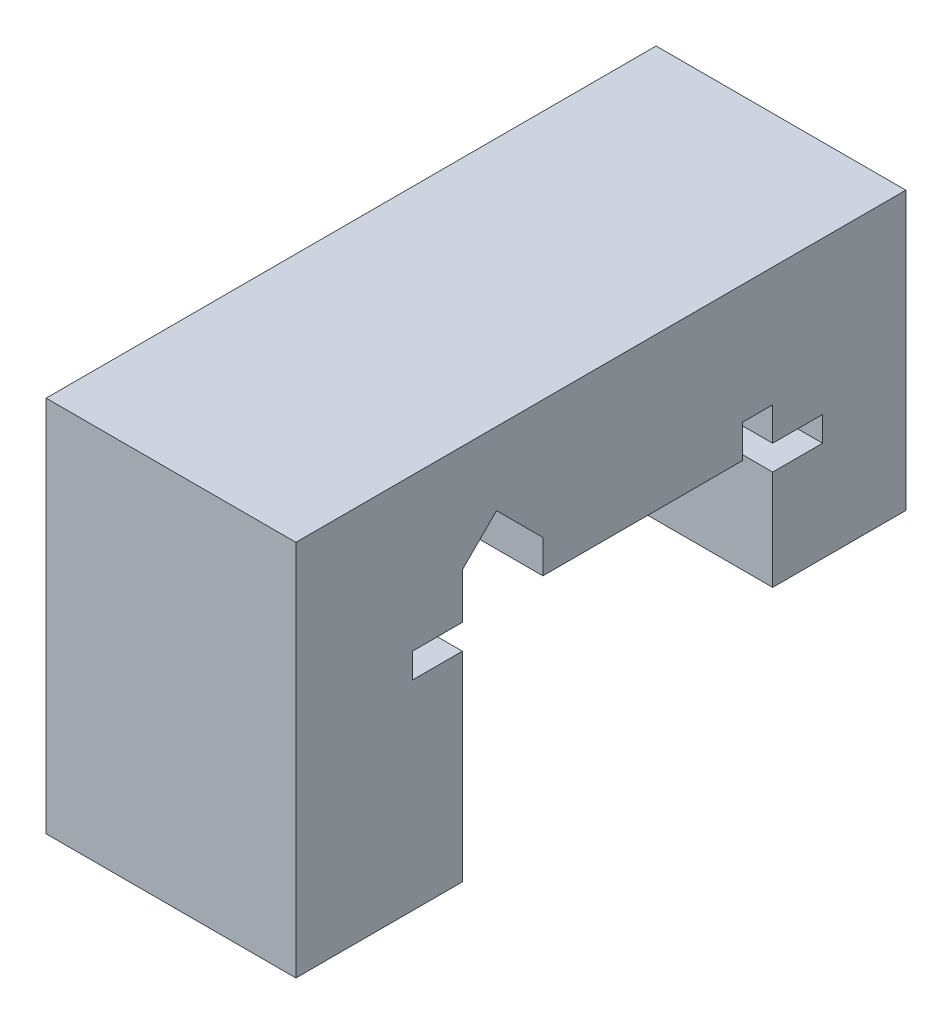
ISO-10303-21;
HEADER;
FILE_DESCRIPTION(('STEP AP214'),'2;1');
FILE_NAME('part.step','',(''),(''),'','','');
FILE_SCHEMA(('AUTOMOTIVE_DESIGN { 1 0 10303 214 1 1 1 1 }'));
ENDSEC;
DATA;
#1=APPLICATION_CONTEXT('core data for automotive mechanical design processes');
#2=APPLICATION_PROTOCOL_DEFINITION('international standard','automotive_design',2000,#1);
#3=PRODUCT_CONTEXT('',#1,'mechanical');
#4=PRODUCT('Part','Part','',(#3));
#5=PRODUCT_RELATED_PRODUCT_CATEGORY('part','',(#4));
#6=PRODUCT_DEFINITION_FORMATION('','',#4);
#7=PRODUCT_DEFINITION_CONTEXT('part definition',#1,'design');
#8=PRODUCT_DEFINITION('design','',#6,#7);
#9=PRODUCT_DEFINITION_SHAPE('','',#8);
#10=(LENGTH_UNIT() NAMED_UNIT(*) SI_UNIT(.MILLI.,.METRE.));
#11=(NAMED_UNIT(*) PLANE_ANGLE_UNIT() SI_UNIT($,.RADIAN.));
#12=(NAMED_UNIT(*) SI_UNIT($,.STERADIAN.) SOLID_ANGLE_UNIT());
#13=UNCERTAINTY_MEASURE_WITH_UNIT(LENGTH_MEASURE(1.E-05),#10,'distance_accuracy_value','');
#14=(GEOMETRIC_REPRESENTATION_CONTEXT(3) GLOBAL_UNCERTAINTY_ASSIGNED_CONTEXT((#13)) GLOBAL_UNIT_ASSIGNED_CONTEXT((#10,
#11,#12)) REPRESENTATION_CONTEXT('',''));
#15=CARTESIAN_POINT('',(0.,0.,0.));
#16=DIRECTION('',(0.,0.,1.));
#17=DIRECTION('',(1.,0.,0.));
#18=AXIS2_PLACEMENT_3D('',#15,#16,#17);
#19=CARTESIAN_POINT('',(150.,0.,0.));
#20=DIRECTION('',(0.,1.,0.));
#21=DIRECTION('',(0.,0.,1.));
#22=AXIS2_PLACEMENT_3D('',#19,#20,#21);
#23=PLANE('',#22);
#24=DIRECTION('',(0.,0.,-1.));
#25=VECTOR('',#24,1.);
#26=CARTESIAN_POINT('',(0.,0.,0.));
#27=LINE('',#26,#25);
#28=CARTESIAN_POINT('',(0.,0.,60.));
#29=VERTEX_POINT('',#28);
#30=CARTESIAN_POINT('',(0.,0.,-60.));
#31=VERTEX_POINT('',#30);
#32=EDGE_CURVE('E130',#29,#31,#27,.T.);
#33=ORIENTED_EDGE('',*,*,#32,.T.);
#34=DIRECTION('',(-1.,0.,0.));
#35=VECTOR('',#34,1.);
#36=CARTESIAN_POINT('',(150.,0.,-60.));
#37=LINE('',#36,#35);
#38=CARTESIAN_POINT('',(150.,0.,-60.));
#39=VERTEX_POINT('',#38);
#40=EDGE_CURVE('E11',#39,#31,#37,.T.);
#41=ORIENTED_EDGE('',*,*,#40,.F.);
#42=DIRECTION('',(0.,0.,-1.));
#43=VECTOR('',#42,1.);
#44=CARTESIAN_POINT('',(150.,0.,0.));
#45=LINE('',#44,#43);
#46=CARTESIAN_POINT('',(150.,0.,60.));
#47=VERTEX_POINT('',#46);
#48=EDGE_CURVE('E136',#47,#39,#45,.T.);
#49=ORIENTED_EDGE('',*,*,#48,.F.);
#50=DIRECTION('',(-1.,0.,0.));
#51=VECTOR('',#50,1.);
#52=CARTESIAN_POINT('',(150.,0.,60.));
#53=LINE('',#52,#51);
#54=EDGE_CURVE('E214',#47,#29,#53,.T.);
#55=ORIENTED_EDGE('',*,*,#54,.T.);
#56=EDGE_LOOP('',(#33,#41,#49,#55));
#57=FACE_BOUND('',#56,.T.);
#58=ADVANCED_FACE('F38',(#57),#23,.F.);
#59=CARTESIAN_POINT('',(150.,20.,-60.));
#60=DIRECTION('',(0.,0.,1.));
#61=DIRECTION('',(1.,0.,0.));
#62=AXIS2_PLACEMENT_3D('',#59,#60,#61);
#63=PLANE('',#62);
#64=DIRECTION('',(0.,1.,0.));
#65=VECTOR('',#64,1.);
#66=CARTESIAN_POINT('',(0.,20.,-60.));
#67=LINE('',#66,#65);
#68=CARTESIAN_POINT('',(0.,20.,-60.));
#69=VERTEX_POINT('',#68);
#70=EDGE_CURVE('E220',#31,#69,#67,.T.);
#71=ORIENTED_EDGE('',*,*,#70,.T.);
#72=DIRECTION('',(-1.,0.,0.));
#73=VECTOR('',#72,1.);
#74=CARTESIAN_POINT('',(150.,20.,-60.));
#75=LINE('',#74,#73);
#76=CARTESIAN_POINT('',(150.,20.,-60.));
#77=VERTEX_POINT('',#76);
#78=EDGE_CURVE('E47',#77,#69,#75,.T.);
#79=ORIENTED_EDGE('',*,*,#78,.F.);
#80=DIRECTION('',(0.,1.,0.));
#81=VECTOR('',#80,1.);
#82=CARTESIAN_POINT('',(150.,20.,-60.));
#83=LINE('',#82,#81);
#84=EDGE_CURVE('E442',#39,#77,#83,.T.);
#85=ORIENTED_EDGE('',*,*,#84,.F.);
#86=ORIENTED_EDGE('',*,*,#40,.T.);
#87=EDGE_LOOP('',(#71,#79,#85,#86));
#88=FACE_BOUND('',#87,.T.);
#89=ADVANCED_FACE('F449',(#88),#63,.F.);
#90=CARTESIAN_POINT('',(150.,20.,-78.0038961668402));
#91=DIRECTION('',(0.,1.,0.));
#92=DIRECTION('',(0.,0.,1.));
#93=AXIS2_PLACEMENT_3D('',#90,#91,#92);
#94=PLANE('',#93);
#95=DIRECTION('',(0.,0.,-1.));
#96=VECTOR('',#95,1.);
#97=CARTESIAN_POINT('',(0.,20.,-78.0038961668402));
#98=LINE('',#97,#96);
#99=CARTESIAN_POINT('',(0.,20.,-78.0038961668402));
#100=VERTEX_POINT('',#99);
#101=EDGE_CURVE('E223',#69,#100,#98,.T.);
#102=ORIENTED_EDGE('',*,*,#101,.T.);
#103=DIRECTION('',(-1.,0.,0.));
#104=VECTOR('',#103,1.);
#105=CARTESIAN_POINT('',(150.,20.,-78.0038961668402));
#106=LINE('',#105,#104);
#107=CARTESIAN_POINT('',(150.,20.,-78.0038961668402));
#108=VERTEX_POINT('',#107);
#109=EDGE_CURVE('E341',#108,#100,#106,.T.);
#110=ORIENTED_EDGE('',*,*,#109,.F.);
#111=DIRECTION('',(0.,0.,-1.));
#112=VECTOR('',#111,1.);
#113=CARTESIAN_POINT('',(150.,20.,-78.0038961668402));
#114=LINE('',#113,#112);
#115=EDGE_CURVE('E353',#77,#108,#114,.T.);
#116=ORIENTED_EDGE('',*,*,#115,.F.);
#117=ORIENTED_EDGE('',*,*,#78,.T.);
#118=EDGE_LOOP('',(#102,#110,#116,#117));
#119=FACE_BOUND('',#118,.T.);
#120=ADVANCED_FACE('F351',(#119),#94,.F.);
#121=CARTESIAN_POINT('',(150.,0.,-78.0038961668402));
#122=DIRECTION('',(0.,0.,-1.));
#123=DIRECTION('',(-1.,0.,0.));
#124=AXIS2_PLACEMENT_3D('',#121,#122,#123);
#125=PLANE('',#124);
#126=DIRECTION('',(0.,-1.,0.));
#127=VECTOR('',#126,1.);
#128=CARTESIAN_POINT('',(0.,0.,-78.0038961668402));
#129=LINE('',#128,#127);
#130=CARTESIAN_POINT('',(0.,0.,-78.0038961668402));
#131=VERTEX_POINT('',#130);
#132=EDGE_CURVE('E226',#100,#131,#129,.T.);
#133=ORIENTED_EDGE('',*,*,#132,.T.);
#134=DIRECTION('',(-1.,0.,0.));
#135=VECTOR('',#134,1.);
#136=CARTESIAN_POINT('',(150.,0.,-78.0038961668402));
#137=LINE('',#136,#135);
#138=CARTESIAN_POINT('',(150.,0.,-78.0038961668402));
#139=VERTEX_POINT('',#138);
#140=EDGE_CURVE('E337',#139,#131,#137,.T.);
#141=ORIENTED_EDGE('',*,*,#140,.F.);
#142=DIRECTION('',(0.,-1.,0.));
#143=VECTOR('',#142,1.);
#144=CARTESIAN_POINT('',(150.,0.,-78.0038961668402));
#145=LINE('',#144,#143);
#146=EDGE_CURVE('E372',#108,#139,#145,.T.);
#147=ORIENTED_EDGE('',*,*,#146,.F.);
#148=ORIENTED_EDGE('',*,*,#109,.T.);
#149=EDGE_LOOP('',(#133,#141,#147,#148));
#150=FACE_BOUND('',#149,.T.);
#151=ADVANCED_FACE('F362',(#150),#125,.F.);
#152=CARTESIAN_POINT('',(150.,0.,-78.0038961668402));
#153=DIRECTION('',(0.,1.,0.));
#154=DIRECTION('',(0.,0.,1.));
#155=AXIS2_PLACEMENT_3D('',#152,#153,#154);
#156=PLANE('',#155);
#157=DIRECTION('',(0.,0.,-1.));
#158=VECTOR('',#157,1.);
#159=CARTESIAN_POINT('',(0.,0.,-78.0038961668402));
#160=LINE('',#159,#158);
#161=CARTESIAN_POINT('',(0.,0.,-108.00389616684));
#162=VERTEX_POINT('',#161);
#163=EDGE_CURVE('E229',#131,#162,#160,.T.);
#164=ORIENTED_EDGE('',*,*,#163,.T.);
#165=DIRECTION('',(-1.,0.,0.));
#166=VECTOR('',#165,1.);
#167=CARTESIAN_POINT('',(150.,0.,-108.00389616684));
#168=LINE('',#167,#166);
#169=CARTESIAN_POINT('',(150.,0.,-108.00389616684));
#170=VERTEX_POINT('',#169);
#171=EDGE_CURVE('E333',#170,#162,#168,.T.);
#172=ORIENTED_EDGE('',*,*,#171,.F.);
#173=DIRECTION('',(0.,0.,-1.));
#174=VECTOR('',#173,1.);
#175=CARTESIAN_POINT('',(150.,0.,-78.0038961668402));
#176=LINE('',#175,#174);
#177=EDGE_CURVE('E368',#139,#170,#176,.T.);
#178=ORIENTED_EDGE('',*,*,#177,.F.);
#179=ORIENTED_EDGE('',*,*,#140,.T.);
#180=EDGE_LOOP('',(#164,#172,#178,#179));
#181=FACE_BOUND('',#180,.T.);
#182=ADVANCED_FACE('F366',(#181),#156,.F.);
#183=CARTESIAN_POINT('',(150.,0.,-108.00389616684));
#184=DIRECTION('',(0.,0.,-1.));
#185=DIRECTION('',(-1.,0.,0.));
#186=AXIS2_PLACEMENT_3D('',#183,#184,#185);
#187=PLANE('',#186);
#188=DIRECTION('',(0.,-1.,0.));
#189=VECTOR('',#188,1.);
#190=CARTESIAN_POINT('',(0.,0.,-108.00389616684));
#191=LINE('',#190,#189);
#192=CARTESIAN_POINT('',(0.,-15.,-108.00389616684));
#193=VERTEX_POINT('',#192);
#194=EDGE_CURVE('E232',#162,#193,#191,.T.);
#195=ORIENTED_EDGE('',*,*,#194,.T.);
#196=DIRECTION('',(-1.,0.,0.));
#197=VECTOR('',#196,1.);
#198=CARTESIAN_POINT('',(150.,-15.,-108.00389616684));
#199=LINE('',#198,#197);
#200=CARTESIAN_POINT('',(150.,-15.,-108.00389616684));
#201=VERTEX_POINT('',#200);
#202=EDGE_CURVE('E329',#201,#193,#199,.T.);
#203=ORIENTED_EDGE('',*,*,#202,.F.);
#204=DIRECTION('',(0.,-1.,0.));
#205=VECTOR('',#204,1.);
#206=CARTESIAN_POINT('',(150.,0.,-108.00389616684));
#207=LINE('',#206,#205);
#208=EDGE_CURVE('E371',#170,#201,#207,.T.);
#209=ORIENTED_EDGE('',*,*,#208,.F.);
#210=ORIENTED_EDGE('',*,*,#171,.T.);
#211=EDGE_LOOP('',(#195,#203,#209,#210));
#212=FACE_BOUND('',#211,.T.);
#213=ADVANCED_FACE('F461',(#212),#187,.F.);
#214=CARTESIAN_POINT('',(150.,-15.,-108.00389616684));
#215=DIRECTION('',(0.,-1.,0.));
#216=DIRECTION('',(0.,0.,-1.));
#217=AXIS2_PLACEMENT_3D('',#214,#215,#216);
#218=PLANE('',#217);
#219=DIRECTION('',(0.,0.,1.));
#220=VECTOR('',#219,1.);
#221=CARTESIAN_POINT('',(0.,-15.,-108.00389616684));
#222=LINE('',#221,#220);
#223=CARTESIAN_POINT('',(0.,-15.,-78.0038961668402));
#224=VERTEX_POINT('',#223);
#225=EDGE_CURVE('E235',#193,#224,#222,.T.);
#226=ORIENTED_EDGE('',*,*,#225,.T.);
#227=DIRECTION('',(-1.,0.,0.));
#228=VECTOR('',#227,1.);
#229=CARTESIAN_POINT('',(150.,-15.,-78.0038961668402));
#230=LINE('',#229,#228);
#231=CARTESIAN_POINT('',(150.,-15.,-78.0038961668402));
#232=VERTEX_POINT('',#231);
#233=EDGE_CURVE('E325',#232,#224,#230,.T.);
#234=ORIENTED_EDGE('',*,*,#233,.F.);
#235=DIRECTION('',(0.,0.,1.));
#236=VECTOR('',#235,1.);
#237=CARTESIAN_POINT('',(150.,-15.,-108.00389616684));
#238=LINE('',#237,#236);
#239=EDGE_CURVE('E377',#201,#232,#238,.T.);
#240=ORIENTED_EDGE('',*,*,#239,.F.);
#241=ORIENTED_EDGE('',*,*,#202,.T.);
#242=EDGE_LOOP('',(#226,#234,#240,#241));
#243=FACE_BOUND('',#242,.T.);
#244=ADVANCED_FACE('F464',(#243),#218,.F.);
#245=CARTESIAN_POINT('',(150.,-15.,-78.0038961668402));
#246=DIRECTION('',(0.,0.,-1.));
#247=DIRECTION('',(0.,1.,0.));
#248=AXIS2_PLACEMENT_3D('',#245,#246,#247);
#249=PLANE('',#248);
#250=DIRECTION('',(0.,-1.,0.));
#251=VECTOR('',#250,1.);
#252=CARTESIAN_POINT('',(0.,-15.,-78.0038961668402));
#253=LINE('',#252,#251);
#254=CARTESIAN_POINT('',(0.,-75.,-78.0038961668402));
#255=VERTEX_POINT('',#254);
#256=EDGE_CURVE('E238',#224,#255,#253,.T.);
#257=ORIENTED_EDGE('',*,*,#256,.T.);
#258=DIRECTION('',(-1.,0.,0.));
#259=VECTOR('',#258,1.);
#260=CARTESIAN_POINT('',(150.,-75.,-78.0038961668402));
#261=LINE('',#260,#259);
#262=CARTESIAN_POINT('',(150.,-75.,-78.0038961668402));
#263=VERTEX_POINT('',#262);
#264=EDGE_CURVE('E321',#263,#255,#261,.T.);
#265=ORIENTED_EDGE('',*,*,#264,.F.);
#266=DIRECTION('',(0.,-1.,0.));
#267=VECTOR('',#266,1.);
#268=CARTESIAN_POINT('',(150.,-15.,-78.0038961668402));
#269=LINE('',#268,#267);
#270=EDGE_CURVE('E384',#232,#263,#269,.T.);
#271=ORIENTED_EDGE('',*,*,#270,.F.);
#272=ORIENTED_EDGE('',*,*,#233,.T.);
#273=EDGE_LOOP('',(#257,#265,#271,#272));
#274=FACE_BOUND('',#273,.T.);
#275=ADVANCED_FACE('F468',(#274),#249,.F.);
#276=CARTESIAN_POINT('',(150.,-75.,-78.0038961668402));
#277=DIRECTION('',(0.,1.,0.));
#278=DIRECTION('',(0.,0.,1.));
#279=AXIS2_PLACEMENT_3D('',#276,#277,#278);
#280=PLANE('',#279);
#281=DIRECTION('',(0.,0.,-1.));
#282=VECTOR('',#281,1.);
#283=CARTESIAN_POINT('',(0.,-75.,-78.0038961668402));
#284=LINE('',#283,#282);
#285=CARTESIAN_POINT('',(0.,-75.,-158.00389616684));
#286=VERTEX_POINT('',#285);
#287=EDGE_CURVE('E241',#255,#286,#284,.T.);
#288=ORIENTED_EDGE('',*,*,#287,.T.);
#289=DIRECTION('',(-1.,0.,0.));
#290=VECTOR('',#289,1.);
#291=CARTESIAN_POINT('',(150.,-75.,-158.00389616684));
#292=LINE('',#291,#290);
#293=CARTESIAN_POINT('',(150.,-75.,-158.00389616684));
#294=VERTEX_POINT('',#293);
#295=EDGE_CURVE('E317',#294,#286,#292,.T.);
#296=ORIENTED_EDGE('',*,*,#295,.F.);
#297=DIRECTION('',(0.,0.,-1.));
#298=VECTOR('',#297,1.);
#299=CARTESIAN_POINT('',(150.,-75.,-78.0038961668402));
#300=LINE('',#299,#298);
#301=EDGE_CURVE('E387',#263,#294,#300,.T.);
#302=ORIENTED_EDGE('',*,*,#301,.F.);
#303=ORIENTED_EDGE('',*,*,#264,.T.);
#304=EDGE_LOOP('',(#288,#296,#302,#303));
#305=FACE_BOUND('',#304,.T.);
#306=ADVANCED_FACE('F472',(#305),#280,.F.);
#307=CARTESIAN_POINT('',(150.,-75.,-158.00389616684));
#308=DIRECTION('',(0.,0.,1.));
#309=DIRECTION('',(1.,0.,0.));
#310=AXIS2_PLACEMENT_3D('',#307,#308,#309);
#311=PLANE('',#310);
#312=DIRECTION('',(0.,1.,0.));
#313=VECTOR('',#312,1.);
#314=CARTESIAN_POINT('',(0.,-75.,-158.00389616684));
#315=LINE('',#314,#313);
#316=CARTESIAN_POINT('',(0.,91.6336075911288,-158.00389616684));
#317=VERTEX_POINT('',#316);
#318=EDGE_CURVE('E244',#286,#317,#315,.T.);
#319=ORIENTED_EDGE('',*,*,#318,.T.);
#320=DIRECTION('',(-1.,0.,0.));
#321=VECTOR('',#320,1.);
#322=CARTESIAN_POINT('',(150.,91.6336075911288,-158.00389616684));
#323=LINE('',#322,#321);
#324=CARTESIAN_POINT('',(150.,91.6336075911288,-158.00389616684));
#325=VERTEX_POINT('',#324);
#326=EDGE_CURVE('E313',#325,#317,#323,.T.);
#327=ORIENTED_EDGE('',*,*,#326,.F.);
#328=DIRECTION('',(0.,1.,0.));
#329=VECTOR('',#328,1.);
#330=CARTESIAN_POINT('',(150.,-75.,-158.00389616684));
#331=LINE('',#330,#329);
#332=EDGE_CURVE('E390',#294,#325,#331,.T.);
#333=ORIENTED_EDGE('',*,*,#332,.F.);
#334=ORIENTED_EDGE('',*,*,#295,.T.);
#335=EDGE_LOOP('',(#319,#327,#333,#334));
#336=FACE_BOUND('',#335,.T.);
#337=ADVANCED_FACE('F476',(#336),#311,.F.);
#338=CARTESIAN_POINT('',(150.,91.6336075911288,-158.00389616684));
#339=DIRECTION('',(0.,-1.,0.));
#340=DIRECTION('',(0.,0.,-1.));
#341=AXIS2_PLACEMENT_3D('',#338,#339,#340);
#342=PLANE('',#341);
#343=DIRECTION('',(0.,0.,1.));
#344=VECTOR('',#343,1.);
#345=CARTESIAN_POINT('',(0.,91.6336075911288,-158.00389616684));
#346=LINE('',#345,#344);
#347=CARTESIAN_POINT('',(0.,91.6336075911288,208.36610383316));
#348=VERTEX_POINT('',#347);
#349=EDGE_CURVE('E247',#317,#348,#346,.T.);
#350=ORIENTED_EDGE('',*,*,#349,.T.);
#351=DIRECTION('',(-1.,0.,0.));
#352=VECTOR('',#351,1.);
#353=CARTESIAN_POINT('',(150.,91.6336075911288,208.36610383316));
#354=LINE('',#353,#352);
#355=CARTESIAN_POINT('',(150.,91.6336075911288,208.36610383316));
#356=VERTEX_POINT('',#355);
#357=EDGE_CURVE('E309',#356,#348,#354,.T.);
#358=ORIENTED_EDGE('',*,*,#357,.F.);
#359=DIRECTION('',(0.,0.,1.));
#360=VECTOR('',#359,1.);
#361=CARTESIAN_POINT('',(150.,91.6336075911288,-158.00389616684));
#362=LINE('',#361,#360);
#363=EDGE_CURVE('E393',#325,#356,#362,.T.);
#364=ORIENTED_EDGE('',*,*,#363,.F.);
#365=ORIENTED_EDGE('',*,*,#326,.T.);
#366=EDGE_LOOP('',(#350,#358,#364,#365));
#367=FACE_BOUND('',#366,.T.);
#368=ADVANCED_FACE('F480',(#367),#342,.F.);
#369=CARTESIAN_POINT('',(150.,91.6336075911288,208.36610383316));
#370=DIRECTION('',(0.,0.,-1.));
#371=DIRECTION('',(0.,1.,0.));
#372=AXIS2_PLACEMENT_3D('',#369,#370,#371);
#373=PLANE('',#372);
#374=DIRECTION('',(0.,-1.,0.));
#375=VECTOR('',#374,1.);
#376=CARTESIAN_POINT('',(0.,91.6336075911288,208.36610383316));
#377=LINE('',#376,#375);
#378=CARTESIAN_POINT('',(0.,-135.,208.36610383316));
#379=VERTEX_POINT('',#378);
#380=EDGE_CURVE('E250',#348,#379,#377,.T.);
#381=ORIENTED_EDGE('',*,*,#380,.T.);
#382=DIRECTION('',(-1.,0.,0.));
#383=VECTOR('',#382,1.);
#384=CARTESIAN_POINT('',(150.,-135.,208.36610383316));
#385=LINE('',#384,#383);
#386=CARTESIAN_POINT('',(150.,-135.,208.36610383316));
#387=VERTEX_POINT('',#386);
#388=EDGE_CURVE('E305',#387,#379,#385,.T.);
#389=ORIENTED_EDGE('',*,*,#388,.F.);
#390=DIRECTION('',(0.,-1.,0.));
#391=VECTOR('',#390,1.);
#392=CARTESIAN_POINT('',(150.,91.6336075911288,208.36610383316));
#393=LINE('',#392,#391);
#394=EDGE_CURVE('E396',#356,#387,#393,.T.);
#395=ORIENTED_EDGE('',*,*,#394,.F.);
#396=ORIENTED_EDGE('',*,*,#357,.T.);
#397=EDGE_LOOP('',(#381,#389,#395,#396));
#398=FACE_BOUND('',#397,.T.);
#399=ADVANCED_FACE('F484',(#398),#373,.F.);
#400=CARTESIAN_POINT('',(150.,-135.,108.36610383316));
#401=DIRECTION('',(0.,1.,0.));
#402=DIRECTION('',(0.,0.,1.));
#403=AXIS2_PLACEMENT_3D('',#400,#401,#402);
#404=PLANE('',#403);
#405=DIRECTION('',(0.,0.,-1.));
#406=VECTOR('',#405,1.);
#407=CARTESIAN_POINT('',(0.,-135.,108.36610383316));
#408=LINE('',#407,#406);
#409=CARTESIAN_POINT('',(0.,-135.,108.36610383316));
#410=VERTEX_POINT('',#409);
#411=EDGE_CURVE('E253',#379,#410,#408,.T.);
#412=ORIENTED_EDGE('',*,*,#411,.T.);
#413=DIRECTION('',(-1.,0.,0.));
#414=VECTOR('',#413,1.);
#415=CARTESIAN_POINT('',(150.,-135.,108.36610383316));
#416=LINE('',#415,#414);
#417=CARTESIAN_POINT('',(150.,-135.,108.36610383316));
#418=VERTEX_POINT('',#417);
#419=EDGE_CURVE('E301',#418,#410,#416,.T.);
#420=ORIENTED_EDGE('',*,*,#419,.F.);
#421=DIRECTION('',(0.,0.,-1.));
#422=VECTOR('',#421,1.);
#423=CARTESIAN_POINT('',(150.,-135.,108.36610383316));
#424=LINE('',#423,#422);
#425=EDGE_CURVE('E399',#387,#418,#424,.T.);
#426=ORIENTED_EDGE('',*,*,#425,.F.);
#427=ORIENTED_EDGE('',*,*,#388,.T.);
#428=EDGE_LOOP('',(#412,#420,#426,#427));
#429=FACE_BOUND('',#428,.T.);
#430=ADVANCED_FACE('F488',(#429),#404,.F.);
#431=CARTESIAN_POINT('',(150.,-15.,108.36610383316));
#432=DIRECTION('',(0.,0.,1.));
#433=DIRECTION('',(0.,-1.,0.));
#434=AXIS2_PLACEMENT_3D('',#431,#432,#433);
#435=PLANE('',#434);
#436=DIRECTION('',(0.,1.,0.));
#437=VECTOR('',#436,1.);
#438=CARTESIAN_POINT('',(0.,-15.,108.36610383316));
#439=LINE('',#438,#437);
#440=CARTESIAN_POINT('',(0.,-15.,108.36610383316));
#441=VERTEX_POINT('',#440);
#442=EDGE_CURVE('E256',#410,#441,#439,.T.);
#443=ORIENTED_EDGE('',*,*,#442,.T.);
#444=DIRECTION('',(-1.,0.,0.));
#445=VECTOR('',#444,1.);
#446=CARTESIAN_POINT('',(150.,-15.,108.36610383316));
#447=LINE('',#446,#445);
#448=CARTESIAN_POINT('',(150.,-15.,108.36610383316));
#449=VERTEX_POINT('',#448);
#450=EDGE_CURVE('E297',#449,#441,#447,.T.);
#451=ORIENTED_EDGE('',*,*,#450,.F.);
#452=DIRECTION('',(0.,1.,0.));
#453=VECTOR('',#452,1.);
#454=CARTESIAN_POINT('',(150.,-15.,108.36610383316));
#455=LINE('',#454,#453);
#456=EDGE_CURVE('E402',#418,#449,#455,.T.);
#457=ORIENTED_EDGE('',*,*,#456,.F.);
#458=ORIENTED_EDGE('',*,*,#419,.T.);
#459=EDGE_LOOP('',(#443,#451,#457,#458));
#460=FACE_BOUND('',#459,.T.);
#461=ADVANCED_FACE('F492',(#460),#435,.F.);
#462=CARTESIAN_POINT('',(150.,-15.,138.36610383316));
#463=DIRECTION('',(0.,-1.,0.));
#464=DIRECTION('',(0.,0.,-1.));
#465=AXIS2_PLACEMENT_3D('',#462,#463,#464);
#466=PLANE('',#465);
#467=DIRECTION('',(0.,0.,1.));
#468=VECTOR('',#467,1.);
#469=CARTESIAN_POINT('',(0.,-15.,138.36610383316));
#470=LINE('',#469,#468);
#471=CARTESIAN_POINT('',(0.,-15.,138.36610383316));
#472=VERTEX_POINT('',#471);
#473=EDGE_CURVE('E259',#441,#472,#470,.T.);
#474=ORIENTED_EDGE('',*,*,#473,.T.);
#475=DIRECTION('',(-1.,0.,0.));
#476=VECTOR('',#475,1.);
#477=CARTESIAN_POINT('',(150.,-15.,138.36610383316));
#478=LINE('',#477,#476);
#479=CARTESIAN_POINT('',(150.,-15.,138.36610383316));
#480=VERTEX_POINT('',#479);
#481=EDGE_CURVE('E293',#480,#472,#478,.T.);
#482=ORIENTED_EDGE('',*,*,#481,.F.);
#483=DIRECTION('',(0.,0.,1.));
#484=VECTOR('',#483,1.);
#485=CARTESIAN_POINT('',(150.,-15.,138.36610383316));
#486=LINE('',#485,#484);
#487=EDGE_CURVE('E405',#449,#480,#486,.T.);
#488=ORIENTED_EDGE('',*,*,#487,.F.);
#489=ORIENTED_EDGE('',*,*,#450,.T.);
#490=EDGE_LOOP('',(#474,#482,#488,#489));
#491=FACE_BOUND('',#490,.T.);
#492=ADVANCED_FACE('F496',(#491),#466,.F.);
#493=CARTESIAN_POINT('',(150.,0.,138.36610383316));
#494=DIRECTION('',(0.,0.,1.));
#495=DIRECTION('',(1.,0.,0.));
#496=AXIS2_PLACEMENT_3D('',#493,#494,#495);
#497=PLANE('',#496);
#498=DIRECTION('',(0.,1.,0.));
#499=VECTOR('',#498,1.);
#500=CARTESIAN_POINT('',(0.,0.,138.36610383316));
#501=LINE('',#500,#499);
#502=CARTESIAN_POINT('',(0.,0.,138.36610383316));
#503=VERTEX_POINT('',#502);
#504=EDGE_CURVE('E262',#472,#503,#501,.T.);
#505=ORIENTED_EDGE('',*,*,#504,.T.);
#506=DIRECTION('',(-1.,0.,0.));
#507=VECTOR('',#506,1.);
#508=CARTESIAN_POINT('',(150.,0.,138.36610383316));
#509=LINE('',#508,#507);
#510=CARTESIAN_POINT('',(150.,0.,138.36610383316));
#511=VERTEX_POINT('',#510);
#512=EDGE_CURVE('E289',#511,#503,#509,.T.);
#513=ORIENTED_EDGE('',*,*,#512,.F.);
#514=DIRECTION('',(0.,1.,0.));
#515=VECTOR('',#514,1.);
#516=CARTESIAN_POINT('',(150.,0.,138.36610383316));
#517=LINE('',#516,#515);
#518=EDGE_CURVE('E408',#480,#511,#517,.T.);
#519=ORIENTED_EDGE('',*,*,#518,.F.);
#520=ORIENTED_EDGE('',*,*,#481,.T.);
#521=EDGE_LOOP('',(#505,#513,#519,#520));
#522=FACE_BOUND('',#521,.T.);
#523=ADVANCED_FACE('F500',(#522),#497,.F.);
#524=CARTESIAN_POINT('',(150.,0.,108.36610383316));
#525=DIRECTION('',(0.,1.,0.));
#526=DIRECTION('',(0.,0.,1.));
#527=AXIS2_PLACEMENT_3D('',#524,#525,#526);
#528=PLANE('',#527);
#529=DIRECTION('',(0.,0.,-1.));
#530=VECTOR('',#529,1.);
#531=CARTESIAN_POINT('',(0.,0.,108.36610383316));
#532=LINE('',#531,#530);
#533=CARTESIAN_POINT('',(0.,0.,108.36610383316));
#534=VERTEX_POINT('',#533);
#535=EDGE_CURVE('E265',#503,#534,#532,.T.);
#536=ORIENTED_EDGE('',*,*,#535,.T.);
#537=DIRECTION('',(-1.,0.,0.));
#538=VECTOR('',#537,1.);
#539=CARTESIAN_POINT('',(150.,0.,108.36610383316));
#540=LINE('',#539,#538);
#541=CARTESIAN_POINT('',(150.,0.,108.36610383316));
#542=VERTEX_POINT('',#541);
#543=EDGE_CURVE('E285',#542,#534,#540,.T.);
#544=ORIENTED_EDGE('',*,*,#543,.F.);
#545=DIRECTION('',(0.,0.,-1.));
#546=VECTOR('',#545,1.);
#547=CARTESIAN_POINT('',(150.,0.,108.36610383316));
#548=LINE('',#547,#546);
#549=EDGE_CURVE('E411',#511,#542,#548,.T.);
#550=ORIENTED_EDGE('',*,*,#549,.F.);
#551=ORIENTED_EDGE('',*,*,#512,.T.);
#552=EDGE_LOOP('',(#536,#544,#550,#551));
#553=FACE_BOUND('',#552,.T.);
#554=ADVANCED_FACE('F433',(#553),#528,.F.);
#555=CARTESIAN_POINT('',(150.,27.3539105243402,108.36610383316));
#556=DIRECTION('',(0.,0.,1.));
#557=DIRECTION('',(1.,0.,0.));
#558=AXIS2_PLACEMENT_3D('',#555,#556,#557);
#559=PLANE('',#558);
#560=DIRECTION('',(0.,1.,0.));
#561=VECTOR('',#560,1.);
#562=CARTESIAN_POINT('',(0.,27.3539105243402,108.36610383316));
#563=LINE('',#562,#561);
#564=CARTESIAN_POINT('',(0.,27.3539105243402,108.36610383316));
#565=VERTEX_POINT('',#564);
#566=EDGE_CURVE('E268',#534,#565,#563,.T.);
#567=ORIENTED_EDGE('',*,*,#566,.T.);
#568=DIRECTION('',(-1.,0.,0.));
#569=VECTOR('',#568,1.);
#570=CARTESIAN_POINT('',(150.,27.3539105243402,108.36610383316));
#571=LINE('',#570,#569);
#572=CARTESIAN_POINT('',(150.,27.3539105243402,108.36610383316));
#573=VERTEX_POINT('',#572);
#574=EDGE_CURVE('E206',#573,#565,#571,.T.);
#575=ORIENTED_EDGE('',*,*,#574,.F.);
#576=DIRECTION('',(0.,1.,0.));
#577=VECTOR('',#576,1.);
#578=CARTESIAN_POINT('',(150.,27.3539105243402,108.36610383316));
#579=LINE('',#578,#577);
#580=EDGE_CURVE('E195',#542,#573,#579,.T.);
#581=ORIENTED_EDGE('',*,*,#580,.F.);
#582=ORIENTED_EDGE('',*,*,#543,.T.);
#583=EDGE_LOOP('',(#567,#575,#581,#582));
#584=FACE_BOUND('',#583,.T.);
#585=ADVANCED_FACE('F437',(#584),#559,.F.);
#586=CARTESIAN_POINT('',(150.,47.86000717875,87.8600071787499));
#587=DIRECTION('',(0.,0.707106781186549,0.707106781186546));
#588=DIRECTION('',(0.,-0.707106781186546,0.707106781186549));
#589=AXIS2_PLACEMENT_3D('',#586,#587,#588);
#590=PLANE('',#589);
#591=DIRECTION('',(0.,0.707106781186546,-0.707106781186549));
#592=VECTOR('',#591,1.);
#593=CARTESIAN_POINT('',(0.,47.86000717875,87.8600071787499));
#594=LINE('',#593,#592);
#595=CARTESIAN_POINT('',(0.,47.86000717875,87.8600071787499));
#596=VERTEX_POINT('',#595);
#597=EDGE_CURVE('E204',#565,#596,#594,.T.);
#598=ORIENTED_EDGE('',*,*,#597,.T.);
#599=DIRECTION('',(-1.,0.,0.));
#600=VECTOR('',#599,1.);
#601=CARTESIAN_POINT('',(150.,47.86000717875,87.8600071787499));
#602=LINE('',#601,#600);
#603=CARTESIAN_POINT('',(150.,47.86000717875,87.8600071787499));
#604=VERTEX_POINT('',#603);
#605=EDGE_CURVE('E201',#604,#596,#602,.T.);
#606=ORIENTED_EDGE('',*,*,#605,.F.);
#607=DIRECTION('',(0.,0.707106781186546,-0.707106781186549));
#608=VECTOR('',#607,1.);
#609=CARTESIAN_POINT('',(150.,47.86000717875,87.8600071787499));
#610=LINE('',#609,#608);
#611=EDGE_CURVE('E189',#573,#604,#610,.T.);
#612=ORIENTED_EDGE('',*,*,#611,.F.);
#613=ORIENTED_EDGE('',*,*,#574,.T.);
#614=EDGE_LOOP('',(#598,#606,#612,#613));
#615=FACE_BOUND('',#614,.T.);
#616=ADVANCED_FACE('F202',(#615),#590,.F.);
#617=CARTESIAN_POINT('',(150.,20.,60.));
#618=DIRECTION('',(0.,0.707106781186546,-0.707106781186549));
#619=DIRECTION('',(0.,0.707106781186549,0.707106781186546));
#620=AXIS2_PLACEMENT_3D('',#617,#618,#619);
#621=PLANE('',#620);
#622=DIRECTION('',(0.,-0.707106781186549,-0.707106781186546));
#623=VECTOR('',#622,1.);
#624=CARTESIAN_POINT('',(0.,20.,60.));
#625=LINE('',#624,#623);
#626=CARTESIAN_POINT('',(0.,20.,60.));
#627=VERTEX_POINT('',#626);
#628=EDGE_CURVE('E123',#596,#627,#625,.T.);
#629=ORIENTED_EDGE('',*,*,#628,.T.);
#630=DIRECTION('',(-1.,0.,0.));
#631=VECTOR('',#630,1.);
#632=CARTESIAN_POINT('',(150.,20.,60.));
#633=LINE('',#632,#631);
#634=CARTESIAN_POINT('',(150.,20.,60.));
#635=VERTEX_POINT('',#634);
#636=EDGE_CURVE('E207',#635,#627,#633,.T.);
#637=ORIENTED_EDGE('',*,*,#636,.F.);
#638=DIRECTION('',(0.,-0.707106781186549,-0.707106781186546));
#639=VECTOR('',#638,1.);
#640=CARTESIAN_POINT('',(150.,20.,60.));
#641=LINE('',#640,#639);
#642=EDGE_CURVE('E193',#604,#635,#641,.T.);
#643=ORIENTED_EDGE('',*,*,#642,.F.);
#644=ORIENTED_EDGE('',*,*,#605,.T.);
#645=EDGE_LOOP('',(#629,#637,#643,#644));
#646=FACE_BOUND('',#645,.T.);
#647=ADVANCED_FACE('F209',(#646),#621,.F.);
#648=CARTESIAN_POINT('',(150.,0.,60.));
#649=DIRECTION('',(0.,0.,-1.));
#650=DIRECTION('',(-1.,0.,0.));
#651=AXIS2_PLACEMENT_3D('',#648,#649,#650);
#652=PLANE('',#651);
#653=DIRECTION('',(0.,-1.,0.));
#654=VECTOR('',#653,1.);
#655=CARTESIAN_POINT('',(0.,0.,60.));
#656=LINE('',#655,#654);
#657=EDGE_CURVE('E275',#627,#29,#656,.T.);
#658=ORIENTED_EDGE('',*,*,#657,.T.);
#659=ORIENTED_EDGE('',*,*,#54,.F.);
#660=DIRECTION('',(0.,-1.,0.));
#661=VECTOR('',#660,1.);
#662=CARTESIAN_POINT('',(150.,0.,60.));
#663=LINE('',#662,#661);
#664=EDGE_CURVE('E55',#635,#47,#663,.T.);
#665=ORIENTED_EDGE('',*,*,#664,.F.);
#666=ORIENTED_EDGE('',*,*,#636,.T.);
#667=EDGE_LOOP('',(#658,#659,#665,#666));
#668=FACE_BOUND('',#667,.T.);
#669=ADVANCED_FACE('F439',(#668),#652,.F.);
#670=CARTESIAN_POINT('',(150.,0.,0.));
#671=DIRECTION('',(-1.,0.,0.));
#672=DIRECTION('',(0.,0.,1.));
#673=AXIS2_PLACEMENT_3D('',#670,#671,#672);
#674=PLANE('',#673);
#675=ORIENTED_EDGE('',*,*,#48,.T.);
#676=ORIENTED_EDGE('',*,*,#84,.T.);
#677=ORIENTED_EDGE('',*,*,#115,.T.);
#678=ORIENTED_EDGE('',*,*,#146,.T.);
#679=ORIENTED_EDGE('',*,*,#177,.T.);
#680=ORIENTED_EDGE('',*,*,#208,.T.);
#681=ORIENTED_EDGE('',*,*,#239,.T.);
#682=ORIENTED_EDGE('',*,*,#270,.T.);
#683=ORIENTED_EDGE('',*,*,#301,.T.);
#684=ORIENTED_EDGE('',*,*,#332,.T.);
#685=ORIENTED_EDGE('',*,*,#363,.T.);
#686=ORIENTED_EDGE('',*,*,#394,.T.);
#687=ORIENTED_EDGE('',*,*,#425,.T.);
#688=ORIENTED_EDGE('',*,*,#456,.T.);
#689=ORIENTED_EDGE('',*,*,#487,.T.);
#690=ORIENTED_EDGE('',*,*,#518,.T.);
#691=ORIENTED_EDGE('',*,*,#549,.T.);
#692=ORIENTED_EDGE('',*,*,#580,.T.);
#693=ORIENTED_EDGE('',*,*,#611,.T.);
#694=ORIENTED_EDGE('',*,*,#642,.T.);
#695=ORIENTED_EDGE('',*,*,#664,.T.);
#696=EDGE_LOOP('',(#675,#676,#677,#678,#679,#680,#681,#682,#683,#684,#685,#686,#687,#688,#689,
#690,#691,#692,#693,#694,#695));
#697=FACE_BOUND('',#696,.T.);
#698=ADVANCED_FACE('F191',(#697),#674,.F.);
#699=CARTESIAN_POINT('',(0.,0.,0.));
#700=DIRECTION('',(-1.,0.,0.));
#701=DIRECTION('',(0.,0.,1.));
#702=AXIS2_PLACEMENT_3D('',#699,#700,#701);
#703=PLANE('',#702);
#704=ORIENTED_EDGE('',*,*,#32,.F.);
#705=ORIENTED_EDGE('',*,*,#657,.F.);
#706=ORIENTED_EDGE('',*,*,#628,.F.);
#707=ORIENTED_EDGE('',*,*,#597,.F.);
#708=ORIENTED_EDGE('',*,*,#566,.F.);
#709=ORIENTED_EDGE('',*,*,#535,.F.);
#710=ORIENTED_EDGE('',*,*,#504,.F.);
#711=ORIENTED_EDGE('',*,*,#473,.F.);
#712=ORIENTED_EDGE('',*,*,#442,.F.);
#713=ORIENTED_EDGE('',*,*,#411,.F.);
#714=ORIENTED_EDGE('',*,*,#380,.F.);
#715=ORIENTED_EDGE('',*,*,#349,.F.);
#716=ORIENTED_EDGE('',*,*,#318,.F.);
#717=ORIENTED_EDGE('',*,*,#287,.F.);
#718=ORIENTED_EDGE('',*,*,#256,.F.);
#719=ORIENTED_EDGE('',*,*,#225,.F.);
#720=ORIENTED_EDGE('',*,*,#194,.F.);
#721=ORIENTED_EDGE('',*,*,#163,.F.);
#722=ORIENTED_EDGE('',*,*,#132,.F.);
#723=ORIENTED_EDGE('',*,*,#101,.F.);
#724=ORIENTED_EDGE('',*,*,#70,.F.);
#725=EDGE_LOOP('',(#704,#705,#706,#707,#708,#709,#710,#711,#712,#713,#714,#715,#716,#717,#718,
#719,#720,#721,#722,#723,#724));
#726=FACE_BOUND('',#725,.T.);
#727=ADVANCED_FACE('F357',(#726),#703,.T.);
#728=CLOSED_SHELL('',(#58,#89,#120,#151,#182,#213,#244,#275,#306,#337,#368,#399,#430,#461,#492,
#523,#554,#585,#616,#647,#669,#698,#727));
#729=MANIFOLD_SOLID_BREP('B2',#728);
#730=ADVANCED_BREP_SHAPE_REPRESENTATION('',(#18,#729),#14);
#731=SHAPE_DEFINITION_REPRESENTATION(#9,#730);
ENDSEC;
END-ISO-10303-21;
